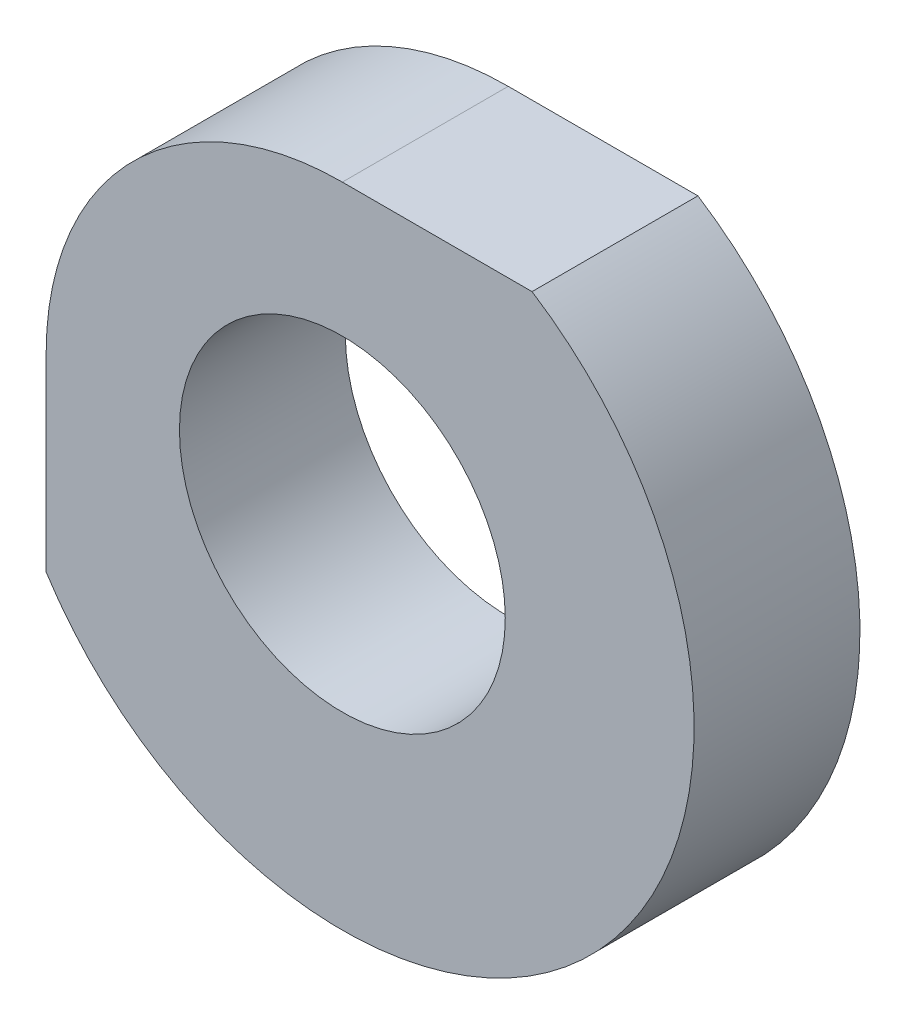
ISO-10303-21;
HEADER;
FILE_DESCRIPTION(('STEP AP214'),'2;1');
FILE_NAME('part.step','',(''),(''),'','','');
FILE_SCHEMA(('AUTOMOTIVE_DESIGN { 1 0 10303 214 1 1 1 1 }'));
ENDSEC;
DATA;
#1=APPLICATION_CONTEXT('core data for automotive mechanical design processes');
#2=APPLICATION_PROTOCOL_DEFINITION('international standard','automotive_design',2000,#1);
#3=PRODUCT_CONTEXT('',#1,'mechanical');
#4=PRODUCT('Part','Part','',(#3));
#5=PRODUCT_RELATED_PRODUCT_CATEGORY('part','',(#4));
#6=PRODUCT_DEFINITION_FORMATION('','',#4);
#7=PRODUCT_DEFINITION_CONTEXT('part definition',#1,'design');
#8=PRODUCT_DEFINITION('design','',#6,#7);
#9=PRODUCT_DEFINITION_SHAPE('','',#8);
#10=(LENGTH_UNIT() NAMED_UNIT(*) SI_UNIT(.MILLI.,.METRE.));
#11=(NAMED_UNIT(*) PLANE_ANGLE_UNIT() SI_UNIT($,.RADIAN.));
#12=(NAMED_UNIT(*) SI_UNIT($,.STERADIAN.) SOLID_ANGLE_UNIT());
#13=UNCERTAINTY_MEASURE_WITH_UNIT(LENGTH_MEASURE(1.E-05),#10,'distance_accuracy_value','');
#14=(GEOMETRIC_REPRESENTATION_CONTEXT(3) GLOBAL_UNCERTAINTY_ASSIGNED_CONTEXT((#13)) GLOBAL_UNIT_ASSIGNED_CONTEXT((#10,
#11,#12)) REPRESENTATION_CONTEXT('',''));
#15=CARTESIAN_POINT('',(0.,0.,0.));
#16=DIRECTION('',(0.,0.,1.));
#17=DIRECTION('',(1.,0.,0.));
#18=AXIS2_PLACEMENT_3D('',#15,#16,#17);
#19=CARTESIAN_POINT('',(-10.5,12.5,-1.));
#20=DIRECTION('',(0.,0.,-1.));
#21=DIRECTION('',(1.,0.,0.));
#22=AXIS2_PLACEMENT_3D('',#19,#20,#21);
#23=CYLINDRICAL_SURFACE('',#22,1.1);
#24=CARTESIAN_POINT('',(-10.5,12.5,-2.12));
#25=DIRECTION('',(0.,0.,1.));
#26=DIRECTION('',(1.,0.,0.));
#27=AXIS2_PLACEMENT_3D('',#24,#25,#26);
#28=CIRCLE('',#27,1.1);
#29=CARTESIAN_POINT('',(-11.6,12.5,-2.12));
#30=VERTEX_POINT('',#29);
#31=EDGE_CURVE('E95',#30,#30,#28,.T.);
#32=ORIENTED_EDGE('',*,*,#31,.F.);
#33=DIRECTION('',(0.,0.,1.));
#34=VECTOR('',#33,1.);
#35=CARTESIAN_POINT('',(-11.6,12.5,-1.));
#36=LINE('',#35,#34);
#37=CARTESIAN_POINT('',(-11.6,12.5,-1.));
#38=VERTEX_POINT('',#37);
#39=EDGE_CURVE('E11',#30,#38,#36,.T.);
#40=ORIENTED_EDGE('',*,*,#39,.T.);
#41=CARTESIAN_POINT('',(-10.5,12.5,-1.));
#42=DIRECTION('',(0.,0.,-1.));
#43=DIRECTION('',(1.,0.,0.));
#44=AXIS2_PLACEMENT_3D('',#41,#42,#43);
#45=CIRCLE('',#44,1.1);
#46=EDGE_CURVE('E114',#38,#38,#45,.T.);
#47=ORIENTED_EDGE('',*,*,#46,.F.);
#48=ORIENTED_EDGE('',*,*,#39,.F.);
#49=EDGE_LOOP('',(#32,#40,#47,#48));
#50=FACE_BOUND('',#49,.T.);
#51=ADVANCED_FACE('F16',(#50),#23,.F.);
#52=CARTESIAN_POINT('',(-10.5,12.5,-1.));
#53=DIRECTION('',(0.,0.,-1.));
#54=DIRECTION('',(0.,1.,0.));
#55=AXIS2_PLACEMENT_3D('',#52,#53,#54);
#56=CYLINDRICAL_SURFACE('',#55,2.);
#57=CARTESIAN_POINT('',(-10.5,12.5,-1.));
#58=DIRECTION('',(0.,0.,1.));
#59=DIRECTION('',(0.,1.,0.));
#60=AXIS2_PLACEMENT_3D('',#57,#58,#59);
#61=CIRCLE('',#60,2.);
#62=CARTESIAN_POINT('',(-10.5,14.5,-1.));
#63=VERTEX_POINT('',#62);
#64=CARTESIAN_POINT('',(-12.5,12.5,-1.));
#65=VERTEX_POINT('',#64);
#66=EDGE_CURVE('E79',#63,#65,#61,.T.);
#67=ORIENTED_EDGE('',*,*,#66,.F.);
#68=DIRECTION('',(0.,0.,-1.));
#69=VECTOR('',#68,1.);
#70=CARTESIAN_POINT('',(-10.5,14.5,-1.));
#71=LINE('',#70,#69);
#72=CARTESIAN_POINT('',(-10.5,14.5,-2.12));
#73=VERTEX_POINT('',#72);
#74=EDGE_CURVE('E26',#63,#73,#71,.T.);
#75=ORIENTED_EDGE('',*,*,#74,.T.);
#76=CARTESIAN_POINT('',(-10.5,12.5,-2.12));
#77=DIRECTION('',(0.,0.,-1.));
#78=DIRECTION('',(0.,1.,0.));
#79=AXIS2_PLACEMENT_3D('',#76,#77,#78);
#80=CIRCLE('',#79,2.);
#81=CARTESIAN_POINT('',(-12.5,12.5,-2.12));
#82=VERTEX_POINT('',#81);
#83=EDGE_CURVE('E76',#82,#73,#80,.T.);
#84=ORIENTED_EDGE('',*,*,#83,.F.);
#85=DIRECTION('',(0.,0.,-1.));
#86=VECTOR('',#85,1.);
#87=CARTESIAN_POINT('',(-12.5,12.5,-1.));
#88=LINE('',#87,#86);
#89=EDGE_CURVE('E84',#65,#82,#88,.T.);
#90=ORIENTED_EDGE('',*,*,#89,.F.);
#91=EDGE_LOOP('',(#67,#75,#84,#90));
#92=FACE_BOUND('',#91,.T.);
#93=ADVANCED_FACE('F74',(#92),#56,.T.);
#94=CARTESIAN_POINT('',(-10.5,14.5,-1.));
#95=DIRECTION('',(0.,1.,0.));
#96=DIRECTION('',(1.,0.,0.));
#97=AXIS2_PLACEMENT_3D('',#94,#95,#96);
#98=PLANE('',#97);
#99=DIRECTION('',(1.,0.,0.));
#100=VECTOR('',#99,1.);
#101=CARTESIAN_POINT('',(-10.5,14.5,-1.));
#102=LINE('',#101,#100);
#103=CARTESIAN_POINT('',(-9.21913115425505,14.5,-1.));
#104=VERTEX_POINT('',#103);
#105=EDGE_CURVE('E19',#63,#104,#102,.T.);
#106=ORIENTED_EDGE('',*,*,#105,.T.);
#107=DIRECTION('',(0.,0.,-1.));
#108=VECTOR('',#107,1.);
#109=CARTESIAN_POINT('',(-9.21913115425505,14.5,-1.));
#110=LINE('',#109,#108);
#111=CARTESIAN_POINT('',(-9.21913115425505,14.5,-2.12));
#112=VERTEX_POINT('',#111);
#113=EDGE_CURVE('E90',#104,#112,#110,.T.);
#114=ORIENTED_EDGE('',*,*,#113,.T.);
#115=DIRECTION('',(1.,0.,0.));
#116=VECTOR('',#115,1.);
#117=CARTESIAN_POINT('',(-10.5,14.5,-2.12));
#118=LINE('',#117,#116);
#119=EDGE_CURVE('E88',#73,#112,#118,.T.);
#120=ORIENTED_EDGE('',*,*,#119,.F.);
#121=ORIENTED_EDGE('',*,*,#74,.F.);
#122=EDGE_LOOP('',(#106,#114,#120,#121));
#123=FACE_BOUND('',#122,.T.);
#124=ADVANCED_FACE('F89',(#123),#98,.T.);
#125=CARTESIAN_POINT('',(-12.5,11.219131154255,-1.));
#126=DIRECTION('',(-1.,0.,0.));
#127=DIRECTION('',(0.,0.,1.));
#128=AXIS2_PLACEMENT_3D('',#125,#126,#127);
#129=PLANE('',#128);
#130=DIRECTION('',(0.,1.,0.));
#131=VECTOR('',#130,1.);
#132=CARTESIAN_POINT('',(-12.5,-7.362,-1.));
#133=LINE('',#132,#131);
#134=CARTESIAN_POINT('',(-12.5,11.219131154255,-1.));
#135=VERTEX_POINT('',#134);
#136=EDGE_CURVE('E115',#135,#65,#133,.T.);
#137=ORIENTED_EDGE('',*,*,#136,.T.);
#138=ORIENTED_EDGE('',*,*,#89,.T.);
#139=DIRECTION('',(0.,1.,0.));
#140=VECTOR('',#139,1.);
#141=CARTESIAN_POINT('',(-12.5,-7.362,-2.12));
#142=LINE('',#141,#140);
#143=CARTESIAN_POINT('',(-12.5,11.219131154255,-2.12));
#144=VERTEX_POINT('',#143);
#145=EDGE_CURVE('E99',#144,#82,#142,.T.);
#146=ORIENTED_EDGE('',*,*,#145,.F.);
#147=DIRECTION('',(0.,0.,-1.));
#148=VECTOR('',#147,1.);
#149=CARTESIAN_POINT('',(-12.5,11.219131154255,-1.));
#150=LINE('',#149,#148);
#151=EDGE_CURVE('E111',#135,#144,#150,.T.);
#152=ORIENTED_EDGE('',*,*,#151,.F.);
#153=EDGE_LOOP('',(#137,#138,#146,#152));
#154=FACE_BOUND('',#153,.T.);
#155=ADVANCED_FACE('F178',(#154),#129,.T.);
#156=CARTESIAN_POINT('',(-10.5,12.5,-1.));
#157=DIRECTION('',(0.,0.,-1.));
#158=DIRECTION('',(0.707106781186549,-0.707106781186547,0.));
#159=AXIS2_PLACEMENT_3D('',#156,#157,#158);
#160=CYLINDRICAL_SURFACE('',#159,2.375);
#161=CARTESIAN_POINT('',(-10.5,12.5,-1.));
#162=DIRECTION('',(0.,0.,1.));
#163=DIRECTION('',(-0.842105263157894,-0.539313198208401,0.));
#164=AXIS2_PLACEMENT_3D('',#161,#162,#163);
#165=CIRCLE('',#164,2.375);
#166=EDGE_CURVE('E121',#135,#104,#165,.T.);
#167=ORIENTED_EDGE('',*,*,#166,.F.);
#168=ORIENTED_EDGE('',*,*,#151,.T.);
#169=CARTESIAN_POINT('',(-10.5,12.5,-2.12));
#170=DIRECTION('',(0.,0.,-1.));
#171=DIRECTION('',(-0.842105263157894,-0.539313198208401,0.));
#172=AXIS2_PLACEMENT_3D('',#169,#170,#171);
#173=CIRCLE('',#172,2.375);
#174=EDGE_CURVE('E107',#112,#144,#173,.T.);
#175=ORIENTED_EDGE('',*,*,#174,.F.);
#176=ORIENTED_EDGE('',*,*,#113,.F.);
#177=EDGE_LOOP('',(#167,#168,#175,#176));
#178=FACE_BOUND('',#177,.T.);
#179=ADVANCED_FACE('F137',(#178),#160,.T.);
#180=CARTESIAN_POINT('',(-10.3125,12.3125,-1.));
#181=DIRECTION('',(0.,0.,1.));
#182=DIRECTION('',(1.,0.,0.));
#183=AXIS2_PLACEMENT_3D('',#180,#181,#182);
#184=PLANE('',#183);
#185=ORIENTED_EDGE('',*,*,#46,.T.);
#186=EDGE_LOOP('',(#185));
#187=FACE_BOUND('',#186,.T.);
#188=ORIENTED_EDGE('',*,*,#166,.T.);
#189=ORIENTED_EDGE('',*,*,#105,.F.);
#190=ORIENTED_EDGE('',*,*,#66,.T.);
#191=ORIENTED_EDGE('',*,*,#136,.F.);
#192=EDGE_LOOP('',(#188,#189,#190,#191));
#193=FACE_BOUND('',#192,.T.);
#194=ADVANCED_FACE('F180',(#187,#193),#184,.T.);
#195=CARTESIAN_POINT('',(-10.3125,12.3125,-2.12));
#196=DIRECTION('',(0.,0.,1.));
#197=DIRECTION('',(1.,0.,0.));
#198=AXIS2_PLACEMENT_3D('',#195,#196,#197);
#199=PLANE('',#198);
#200=ORIENTED_EDGE('',*,*,#31,.T.);
#201=EDGE_LOOP('',(#200));
#202=FACE_BOUND('',#201,.T.);
#203=ORIENTED_EDGE('',*,*,#174,.T.);
#204=ORIENTED_EDGE('',*,*,#145,.T.);
#205=ORIENTED_EDGE('',*,*,#83,.T.);
#206=ORIENTED_EDGE('',*,*,#119,.T.);
#207=EDGE_LOOP('',(#203,#204,#205,#206));
#208=FACE_BOUND('',#207,.T.);
#209=ADVANCED_FACE('F97',(#202,#208),#199,.F.);
#210=CLOSED_SHELL('',(#51,#93,#124,#155,#179,#194,#209));
#211=MANIFOLD_SOLID_BREP('B1',#210);
#212=ADVANCED_BREP_SHAPE_REPRESENTATION('',(#18,#211),#14);
#213=SHAPE_DEFINITION_REPRESENTATION(#9,#212);
ENDSEC;
END-ISO-10303-21;
